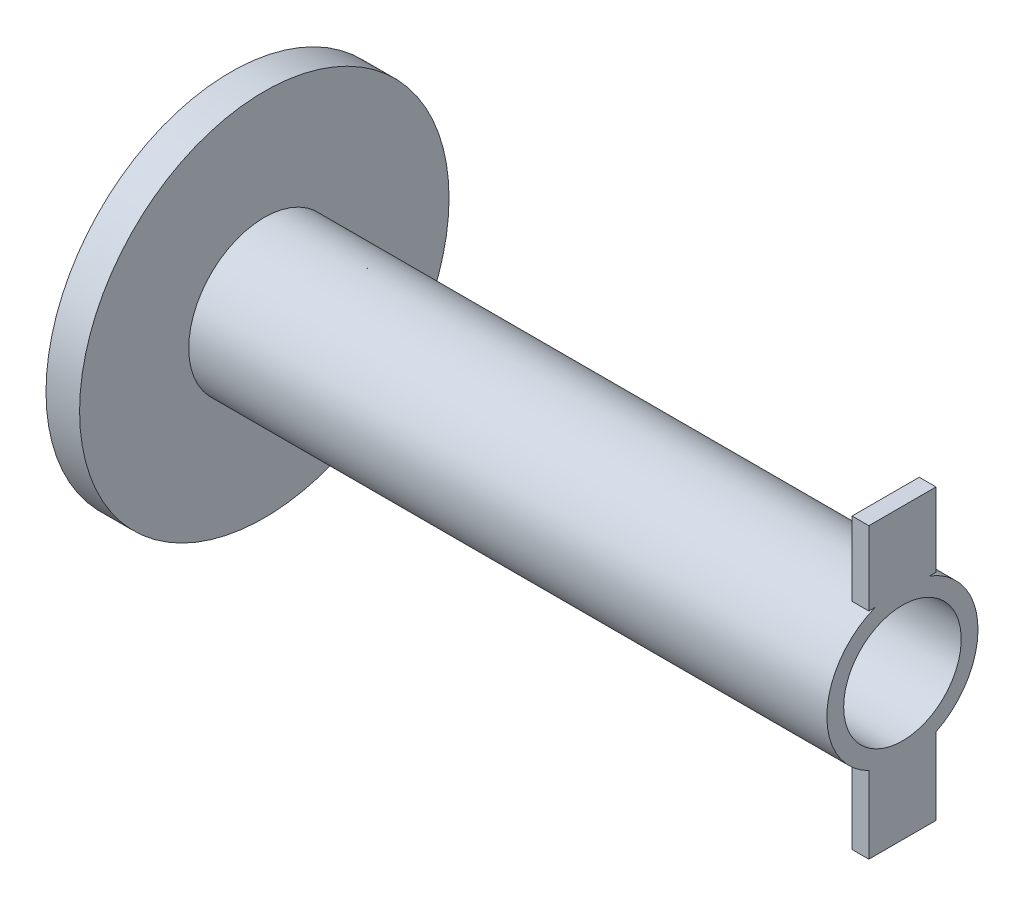
ISO-10303-21;
HEADER;
FILE_DESCRIPTION(('STEP AP214'),'2;1');
FILE_NAME('part.step','',(''),(''),'','','');
FILE_SCHEMA(('AUTOMOTIVE_DESIGN { 1 0 10303 214 1 1 1 1 }'));
ENDSEC;
DATA;
#1=APPLICATION_CONTEXT('core data for automotive mechanical design processes');
#2=APPLICATION_PROTOCOL_DEFINITION('international standard','automotive_design',2000,#1);
#3=PRODUCT_CONTEXT('',#1,'mechanical');
#4=PRODUCT('Part','Part','',(#3));
#5=PRODUCT_RELATED_PRODUCT_CATEGORY('part','',(#4));
#6=PRODUCT_DEFINITION_FORMATION('','',#4);
#7=PRODUCT_DEFINITION_CONTEXT('part definition',#1,'design');
#8=PRODUCT_DEFINITION('design','',#6,#7);
#9=PRODUCT_DEFINITION_SHAPE('','',#8);
#10=(LENGTH_UNIT() NAMED_UNIT(*) SI_UNIT(.MILLI.,.METRE.));
#11=(NAMED_UNIT(*) PLANE_ANGLE_UNIT() SI_UNIT($,.RADIAN.));
#12=(NAMED_UNIT(*) SI_UNIT($,.STERADIAN.) SOLID_ANGLE_UNIT());
#13=UNCERTAINTY_MEASURE_WITH_UNIT(LENGTH_MEASURE(1.E-05),#10,'distance_accuracy_value','');
#14=(GEOMETRIC_REPRESENTATION_CONTEXT(3) GLOBAL_UNCERTAINTY_ASSIGNED_CONTEXT((#13)) GLOBAL_UNIT_ASSIGNED_CONTEXT((#10,
#11,#12)) REPRESENTATION_CONTEXT('',''));
#15=CARTESIAN_POINT('',(0.,0.,0.));
#16=DIRECTION('',(0.,0.,1.));
#17=DIRECTION('',(1.,0.,0.));
#18=AXIS2_PLACEMENT_3D('',#15,#16,#17);
#19=CARTESIAN_POINT('',(10.,0.,0.));
#20=DIRECTION('',(-1.,0.,0.));
#21=DIRECTION('',(0.,0.,1.));
#22=AXIS2_PLACEMENT_3D('',#19,#20,#21);
#23=CYLINDRICAL_SURFACE('',#22,55.);
#24=CARTESIAN_POINT('',(10.,0.,0.));
#25=DIRECTION('',(1.,0.,0.));
#26=DIRECTION('',(0.,0.,-1.));
#27=AXIS2_PLACEMENT_3D('',#24,#25,#26);
#28=CIRCLE('',#27,55.);
#29=CARTESIAN_POINT('',(10.,0.,-55.));
#30=VERTEX_POINT('',#29);
#31=EDGE_CURVE('E198',#30,#30,#28,.T.);
#32=ORIENTED_EDGE('',*,*,#31,.F.);
#33=EDGE_LOOP('',(#32));
#34=FACE_BOUND('',#33,.T.);
#35=CARTESIAN_POINT('',(0.,0.,0.));
#36=DIRECTION('',(1.,0.,0.));
#37=DIRECTION('',(0.,0.,-1.));
#38=AXIS2_PLACEMENT_3D('',#35,#36,#37);
#39=CIRCLE('',#38,55.);
#40=CARTESIAN_POINT('',(0.,0.,-55.));
#41=VERTEX_POINT('',#40);
#42=EDGE_CURVE('E194',#41,#41,#39,.T.);
#43=ORIENTED_EDGE('',*,*,#42,.T.);
#44=EDGE_LOOP('',(#43));
#45=FACE_BOUND('',#44,.T.);
#46=ADVANCED_FACE('F36',(#34,#45),#23,.T.);
#47=CARTESIAN_POINT('',(10.,0.,0.));
#48=DIRECTION('',(1.,0.,0.));
#49=DIRECTION('',(0.,0.,-1.));
#50=AXIS2_PLACEMENT_3D('',#47,#48,#49);
#51=PLANE('',#50);
#52=CARTESIAN_POINT('',(10.,0.,0.));
#53=DIRECTION('',(1.,0.,0.));
#54=DIRECTION('',(0.,0.,-1.));
#55=AXIS2_PLACEMENT_3D('',#52,#53,#54);
#56=CIRCLE('',#55,22.5);
#57=CARTESIAN_POINT('',(10.,0.,-22.5));
#58=VERTEX_POINT('',#57);
#59=EDGE_CURVE('E195',#58,#58,#56,.T.);
#60=ORIENTED_EDGE('',*,*,#59,.F.);
#61=EDGE_LOOP('',(#60));
#62=FACE_BOUND('',#61,.T.);
#63=ORIENTED_EDGE('',*,*,#31,.T.);
#64=EDGE_LOOP('',(#63));
#65=FACE_BOUND('',#64,.T.);
#66=ADVANCED_FACE('F231',(#62,#65),#51,.T.);
#67=CARTESIAN_POINT('',(0.,0.,0.));
#68=DIRECTION('',(1.,0.,0.));
#69=DIRECTION('',(0.,0.,-1.));
#70=AXIS2_PLACEMENT_3D('',#67,#68,#69);
#71=PLANE('',#70);
#72=CARTESIAN_POINT('',(0.,0.,0.));
#73=DIRECTION('',(1.,0.,0.));
#74=DIRECTION('',(0.,0.,-1.));
#75=AXIS2_PLACEMENT_3D('',#72,#73,#74);
#76=CIRCLE('',#75,17.5);
#77=CARTESIAN_POINT('',(0.,0.,-17.5));
#78=VERTEX_POINT('',#77);
#79=EDGE_CURVE('E188',#78,#78,#76,.T.);
#80=ORIENTED_EDGE('',*,*,#79,.T.);
#81=EDGE_LOOP('',(#80));
#82=FACE_BOUND('',#81,.T.);
#83=ORIENTED_EDGE('',*,*,#42,.F.);
#84=EDGE_LOOP('',(#83));
#85=FACE_BOUND('',#84,.T.);
#86=ADVANCED_FACE('F228',(#82,#85),#71,.F.);
#87=CARTESIAN_POINT('',(200.,0.,0.));
#88=DIRECTION('',(-1.,0.,0.));
#89=DIRECTION('',(0.,0.,1.));
#90=AXIS2_PLACEMENT_3D('',#87,#88,#89);
#91=CYLINDRICAL_SURFACE('',#90,22.5);
#92=CARTESIAN_POINT('',(200.,0.,0.));
#93=DIRECTION('',(1.,0.,0.));
#94=DIRECTION('',(0.,0.,-1.));
#95=AXIS2_PLACEMENT_3D('',#92,#93,#94);
#96=CIRCLE('',#95,22.5);
#97=CARTESIAN_POINT('',(200.,-20.1556443707464,-10.));
#98=VERTEX_POINT('',#97);
#99=CARTESIAN_POINT('',(200.,21.,-8.07774721070176));
#100=VERTEX_POINT('',#99);
#101=EDGE_CURVE('E191',#98,#100,#96,.T.);
#102=ORIENTED_EDGE('',*,*,#101,.F.);
#103=DIRECTION('',(-1.,0.,0.));
#104=VECTOR('',#103,1.);
#105=CARTESIAN_POINT('',(200.,-20.1556443707464,-10.));
#106=LINE('',#105,#104);
#107=CARTESIAN_POINT('',(195.,-20.1556443707464,-10.));
#108=VERTEX_POINT('',#107);
#109=EDGE_CURVE('E144',#98,#108,#106,.T.);
#110=ORIENTED_EDGE('',*,*,#109,.T.);
#111=CARTESIAN_POINT('',(195.,0.,0.));
#112=DIRECTION('',(1.,0.,0.));
#113=DIRECTION('',(0.,0.,-1.));
#114=AXIS2_PLACEMENT_3D('',#111,#112,#113);
#115=CIRCLE('',#114,22.5);
#116=CARTESIAN_POINT('',(195.,-20.1556443707464,10.));
#117=VERTEX_POINT('',#116);
#118=EDGE_CURVE('E11',#117,#108,#115,.T.);
#119=ORIENTED_EDGE('',*,*,#118,.F.);
#120=DIRECTION('',(-1.,0.,0.));
#121=VECTOR('',#120,1.);
#122=CARTESIAN_POINT('',(200.,-20.1556443707464,10.));
#123=LINE('',#122,#121);
#124=CARTESIAN_POINT('',(200.,-20.1556443707464,10.));
#125=VERTEX_POINT('',#124);
#126=EDGE_CURVE('E119',#117,#125,#123,.F.);
#127=ORIENTED_EDGE('',*,*,#126,.T.);
#128=CARTESIAN_POINT('',(200.,21.,8.07774721070176));
#129=VERTEX_POINT('',#128);
#130=EDGE_CURVE('E192',#129,#125,#96,.T.);
#131=ORIENTED_EDGE('',*,*,#130,.F.);
#132=DIRECTION('',(-1.,0.,0.));
#133=VECTOR('',#132,1.);
#134=CARTESIAN_POINT('',(200.,21.,8.07774721070176));
#135=LINE('',#134,#133);
#136=CARTESIAN_POINT('',(195.,21.,8.07774721070176));
#137=VERTEX_POINT('',#136);
#138=EDGE_CURVE('E182',#129,#137,#135,.T.);
#139=ORIENTED_EDGE('',*,*,#138,.T.);
#140=CARTESIAN_POINT('',(195.,0.,0.));
#141=DIRECTION('',(1.,0.,0.));
#142=DIRECTION('',(0.,0.,-1.));
#143=AXIS2_PLACEMENT_3D('',#140,#141,#142);
#144=CIRCLE('',#143,22.5);
#145=CARTESIAN_POINT('',(195.,21.,-8.07774721070176));
#146=VERTEX_POINT('',#145);
#147=EDGE_CURVE('E43',#146,#137,#144,.T.);
#148=ORIENTED_EDGE('',*,*,#147,.F.);
#149=DIRECTION('',(-1.,0.,0.));
#150=VECTOR('',#149,1.);
#151=CARTESIAN_POINT('',(200.,21.,-8.07774721070176));
#152=LINE('',#151,#150);
#153=EDGE_CURVE('E174',#146,#100,#152,.F.);
#154=ORIENTED_EDGE('',*,*,#153,.T.);
#155=EDGE_LOOP('',(#102,#110,#119,#127,#131,#139,#148,#154));
#156=FACE_BOUND('',#155,.T.);
#157=ORIENTED_EDGE('',*,*,#59,.T.);
#158=EDGE_LOOP('',(#157));
#159=FACE_BOUND('',#158,.T.);
#160=ADVANCED_FACE('F214',(#156,#159),#91,.T.);
#161=CARTESIAN_POINT('',(200.,0.,0.));
#162=DIRECTION('',(1.,0.,0.));
#163=DIRECTION('',(0.,0.,-1.));
#164=AXIS2_PLACEMENT_3D('',#161,#162,#163);
#165=PLANE('',#164);
#166=ORIENTED_EDGE('',*,*,#130,.T.);
#167=DIRECTION('',(0.,-1.,0.));
#168=VECTOR('',#167,1.);
#169=CARTESIAN_POINT('',(200.,-20.,10.));
#170=LINE('',#169,#168);
#171=CARTESIAN_POINT('',(200.,-43.,9.99999999999999));
#172=VERTEX_POINT('',#171);
#173=EDGE_CURVE('E139',#125,#172,#170,.T.);
#174=ORIENTED_EDGE('',*,*,#173,.T.);
#175=DIRECTION('',(0.,0.,-1.));
#176=VECTOR('',#175,1.);
#177=CARTESIAN_POINT('',(200.,-43.,9.99999999999999));
#178=LINE('',#177,#176);
#179=CARTESIAN_POINT('',(200.,-43.,-10.));
#180=VERTEX_POINT('',#179);
#181=EDGE_CURVE('E129',#172,#180,#178,.T.);
#182=ORIENTED_EDGE('',*,*,#181,.T.);
#183=DIRECTION('',(0.,1.,0.));
#184=VECTOR('',#183,1.);
#185=CARTESIAN_POINT('',(200.,-20.,-10.));
#186=LINE('',#185,#184);
#187=EDGE_CURVE('E50',#180,#98,#186,.T.);
#188=ORIENTED_EDGE('',*,*,#187,.T.);
#189=ORIENTED_EDGE('',*,*,#101,.T.);
#190=DIRECTION('',(0.,0.,-1.));
#191=VECTOR('',#190,1.);
#192=CARTESIAN_POINT('',(200.,21.,10.));
#193=LINE('',#192,#191);
#194=CARTESIAN_POINT('',(200.,21.,-10.));
#195=VERTEX_POINT('',#194);
#196=EDGE_CURVE('E169',#100,#195,#193,.T.);
#197=ORIENTED_EDGE('',*,*,#196,.T.);
#198=DIRECTION('',(0.,1.,0.));
#199=VECTOR('',#198,1.);
#200=CARTESIAN_POINT('',(200.,43.,-10.));
#201=LINE('',#200,#199);
#202=CARTESIAN_POINT('',(200.,43.,-10.));
#203=VERTEX_POINT('',#202);
#204=EDGE_CURVE('E147',#195,#203,#201,.T.);
#205=ORIENTED_EDGE('',*,*,#204,.T.);
#206=DIRECTION('',(0.,0.,1.));
#207=VECTOR('',#206,1.);
#208=CARTESIAN_POINT('',(200.,43.,10.));
#209=LINE('',#208,#207);
#210=CARTESIAN_POINT('',(200.,43.,10.));
#211=VERTEX_POINT('',#210);
#212=EDGE_CURVE('E164',#203,#211,#209,.T.);
#213=ORIENTED_EDGE('',*,*,#212,.T.);
#214=DIRECTION('',(0.,-1.,0.));
#215=VECTOR('',#214,1.);
#216=CARTESIAN_POINT('',(200.,43.,10.));
#217=LINE('',#216,#215);
#218=CARTESIAN_POINT('',(200.,21.,10.));
#219=VERTEX_POINT('',#218);
#220=EDGE_CURVE('E167',#211,#219,#217,.T.);
#221=ORIENTED_EDGE('',*,*,#220,.T.);
#222=EDGE_CURVE('E57',#219,#129,#193,.T.);
#223=ORIENTED_EDGE('',*,*,#222,.T.);
#224=EDGE_LOOP('',(#166,#174,#182,#188,#189,#197,#205,#213,#221,#223));
#225=FACE_BOUND('',#224,.T.);
#226=CARTESIAN_POINT('',(200.,0.,0.));
#227=DIRECTION('',(-1.,0.,0.));
#228=DIRECTION('',(0.,0.,1.));
#229=AXIS2_PLACEMENT_3D('',#226,#227,#228);
#230=CIRCLE('',#229,17.5);
#231=CARTESIAN_POINT('',(200.,0.,17.5));
#232=VERTEX_POINT('',#231);
#233=EDGE_CURVE('E185',#232,#232,#230,.T.);
#234=ORIENTED_EDGE('',*,*,#233,.T.);
#235=EDGE_LOOP('',(#234));
#236=FACE_BOUND('',#235,.T.);
#237=ADVANCED_FACE('F216',(#225,#236),#165,.T.);
#238=CARTESIAN_POINT('',(200.,0.,0.));
#239=DIRECTION('',(-1.,0.,0.));
#240=DIRECTION('',(0.,0.,1.));
#241=AXIS2_PLACEMENT_3D('',#238,#239,#240);
#242=CYLINDRICAL_SURFACE('',#241,17.5);
#243=ORIENTED_EDGE('',*,*,#233,.F.);
#244=EDGE_LOOP('',(#243));
#245=FACE_BOUND('',#244,.T.);
#246=ORIENTED_EDGE('',*,*,#79,.F.);
#247=EDGE_LOOP('',(#246));
#248=FACE_BOUND('',#247,.T.);
#249=ADVANCED_FACE('F219',(#245,#248),#242,.F.);
#250=CARTESIAN_POINT('',(195.,21.,10.));
#251=DIRECTION('',(0.,-1.,0.));
#252=DIRECTION('',(0.,0.,-1.));
#253=AXIS2_PLACEMENT_3D('',#250,#251,#252);
#254=PLANE('',#253);
#255=ORIENTED_EDGE('',*,*,#138,.F.);
#256=ORIENTED_EDGE('',*,*,#222,.F.);
#257=DIRECTION('',(1.,0.,0.));
#258=VECTOR('',#257,1.);
#259=CARTESIAN_POINT('',(195.,21.,10.));
#260=LINE('',#259,#258);
#261=CARTESIAN_POINT('',(195.,21.,10.));
#262=VERTEX_POINT('',#261);
#263=EDGE_CURVE('E175',#262,#219,#260,.T.);
#264=ORIENTED_EDGE('',*,*,#263,.F.);
#265=DIRECTION('',(0.,0.,-1.));
#266=VECTOR('',#265,1.);
#267=CARTESIAN_POINT('',(195.,21.,10.));
#268=LINE('',#267,#266);
#269=EDGE_CURVE('E158',#262,#137,#268,.T.);
#270=ORIENTED_EDGE('',*,*,#269,.T.);
#271=EDGE_LOOP('',(#255,#256,#264,#270));
#272=FACE_BOUND('',#271,.T.);
#273=ADVANCED_FACE('F211',(#272),#254,.T.);
#274=ORIENTED_EDGE('',*,*,#153,.F.);
#275=CARTESIAN_POINT('',(195.,21.,-10.));
#276=VERTEX_POINT('',#275);
#277=EDGE_CURVE('E157',#146,#276,#268,.T.);
#278=ORIENTED_EDGE('',*,*,#277,.T.);
#279=DIRECTION('',(1.,0.,0.));
#280=VECTOR('',#279,1.);
#281=CARTESIAN_POINT('',(195.,21.,-10.));
#282=LINE('',#281,#280);
#283=EDGE_CURVE('E171',#276,#195,#282,.T.);
#284=ORIENTED_EDGE('',*,*,#283,.T.);
#285=ORIENTED_EDGE('',*,*,#196,.F.);
#286=EDGE_LOOP('',(#274,#278,#284,#285));
#287=FACE_BOUND('',#286,.T.);
#288=ADVANCED_FACE('F253',(#287),#254,.T.);
#289=CARTESIAN_POINT('',(195.,43.,-10.));
#290=DIRECTION('',(0.,0.,-1.));
#291=DIRECTION('',(0.,1.,0.));
#292=AXIS2_PLACEMENT_3D('',#289,#290,#291);
#293=PLANE('',#292);
#294=ORIENTED_EDGE('',*,*,#204,.F.);
#295=ORIENTED_EDGE('',*,*,#283,.F.);
#296=DIRECTION('',(0.,1.,0.));
#297=VECTOR('',#296,1.);
#298=CARTESIAN_POINT('',(195.,43.,-10.));
#299=LINE('',#298,#297);
#300=CARTESIAN_POINT('',(195.,43.,-10.));
#301=VERTEX_POINT('',#300);
#302=EDGE_CURVE('E148',#276,#301,#299,.T.);
#303=ORIENTED_EDGE('',*,*,#302,.T.);
#304=DIRECTION('',(1.,0.,0.));
#305=VECTOR('',#304,1.);
#306=CARTESIAN_POINT('',(195.,43.,-10.));
#307=LINE('',#306,#305);
#308=EDGE_CURVE('E161',#301,#203,#307,.T.);
#309=ORIENTED_EDGE('',*,*,#308,.T.);
#310=EDGE_LOOP('',(#294,#295,#303,#309));
#311=FACE_BOUND('',#310,.T.);
#312=ADVANCED_FACE('F249',(#311),#293,.T.);
#313=CARTESIAN_POINT('',(195.,43.,10.));
#314=DIRECTION('',(0.,0.,1.));
#315=DIRECTION('',(0.,-1.,0.));
#316=AXIS2_PLACEMENT_3D('',#313,#314,#315);
#317=PLANE('',#316);
#318=ORIENTED_EDGE('',*,*,#220,.F.);
#319=DIRECTION('',(1.,0.,0.));
#320=VECTOR('',#319,1.);
#321=CARTESIAN_POINT('',(195.,43.,10.));
#322=LINE('',#321,#320);
#323=CARTESIAN_POINT('',(195.,43.,10.));
#324=VERTEX_POINT('',#323);
#325=EDGE_CURVE('E177',#324,#211,#322,.T.);
#326=ORIENTED_EDGE('',*,*,#325,.F.);
#327=DIRECTION('',(0.,-1.,0.));
#328=VECTOR('',#327,1.);
#329=CARTESIAN_POINT('',(195.,43.,10.));
#330=LINE('',#329,#328);
#331=EDGE_CURVE('E154',#324,#262,#330,.T.);
#332=ORIENTED_EDGE('',*,*,#331,.T.);
#333=ORIENTED_EDGE('',*,*,#263,.T.);
#334=EDGE_LOOP('',(#318,#326,#332,#333));
#335=FACE_BOUND('',#334,.T.);
#336=ADVANCED_FACE('F252',(#335),#317,.T.);
#337=CARTESIAN_POINT('',(195.,43.,10.));
#338=DIRECTION('',(0.,1.,0.));
#339=DIRECTION('',(0.,0.,1.));
#340=AXIS2_PLACEMENT_3D('',#337,#338,#339);
#341=PLANE('',#340);
#342=ORIENTED_EDGE('',*,*,#212,.F.);
#343=ORIENTED_EDGE('',*,*,#308,.F.);
#344=DIRECTION('',(0.,0.,1.));
#345=VECTOR('',#344,1.);
#346=CARTESIAN_POINT('',(195.,43.,10.));
#347=LINE('',#346,#345);
#348=EDGE_CURVE('E151',#301,#324,#347,.T.);
#349=ORIENTED_EDGE('',*,*,#348,.T.);
#350=ORIENTED_EDGE('',*,*,#325,.T.);
#351=EDGE_LOOP('',(#342,#343,#349,#350));
#352=FACE_BOUND('',#351,.T.);
#353=ADVANCED_FACE('F255',(#352),#341,.T.);
#354=CARTESIAN_POINT('',(195.,0.,0.));
#355=DIRECTION('',(1.,0.,0.));
#356=DIRECTION('',(0.,0.,-1.));
#357=AXIS2_PLACEMENT_3D('',#354,#355,#356);
#358=PLANE('',#357);
#359=ORIENTED_EDGE('',*,*,#277,.F.);
#360=ORIENTED_EDGE('',*,*,#147,.T.);
#361=ORIENTED_EDGE('',*,*,#269,.F.);
#362=ORIENTED_EDGE('',*,*,#331,.F.);
#363=ORIENTED_EDGE('',*,*,#348,.F.);
#364=ORIENTED_EDGE('',*,*,#302,.F.);
#365=EDGE_LOOP('',(#359,#360,#361,#362,#363,#364));
#366=FACE_BOUND('',#365,.T.);
#367=ADVANCED_FACE('F206',(#366),#358,.F.);
#368=CARTESIAN_POINT('',(195.,-20.,-10.));
#369=DIRECTION('',(0.,0.,-1.));
#370=DIRECTION('',(0.,1.,0.));
#371=AXIS2_PLACEMENT_3D('',#368,#369,#370);
#372=PLANE('',#371);
#373=ORIENTED_EDGE('',*,*,#109,.F.);
#374=ORIENTED_EDGE('',*,*,#187,.F.);
#375=DIRECTION('',(1.,0.,0.));
#376=VECTOR('',#375,1.);
#377=CARTESIAN_POINT('',(195.,-43.,-10.));
#378=LINE('',#377,#376);
#379=CARTESIAN_POINT('',(195.,-43.,-10.));
#380=VERTEX_POINT('',#379);
#381=EDGE_CURVE('E130',#380,#180,#378,.T.);
#382=ORIENTED_EDGE('',*,*,#381,.F.);
#383=DIRECTION('',(0.,1.,0.));
#384=VECTOR('',#383,1.);
#385=CARTESIAN_POINT('',(195.,-20.,-10.));
#386=LINE('',#385,#384);
#387=EDGE_CURVE('E124',#380,#108,#386,.T.);
#388=ORIENTED_EDGE('',*,*,#387,.T.);
#389=EDGE_LOOP('',(#373,#374,#382,#388));
#390=FACE_BOUND('',#389,.T.);
#391=ADVANCED_FACE('F266',(#390),#372,.T.);
#392=CARTESIAN_POINT('',(195.,-20.,10.));
#393=DIRECTION('',(0.,0.,1.));
#394=DIRECTION('',(0.,-1.,0.));
#395=AXIS2_PLACEMENT_3D('',#392,#393,#394);
#396=PLANE('',#395);
#397=ORIENTED_EDGE('',*,*,#126,.F.);
#398=DIRECTION('',(0.,-1.,0.));
#399=VECTOR('',#398,1.);
#400=CARTESIAN_POINT('',(195.,-20.,10.));
#401=LINE('',#400,#399);
#402=CARTESIAN_POINT('',(195.,-43.,9.99999999999999));
#403=VERTEX_POINT('',#402);
#404=EDGE_CURVE('E113',#117,#403,#401,.T.);
#405=ORIENTED_EDGE('',*,*,#404,.T.);
#406=DIRECTION('',(1.,0.,0.));
#407=VECTOR('',#406,1.);
#408=CARTESIAN_POINT('',(195.,-43.,9.99999999999999));
#409=LINE('',#408,#407);
#410=EDGE_CURVE('E116',#403,#172,#409,.T.);
#411=ORIENTED_EDGE('',*,*,#410,.T.);
#412=ORIENTED_EDGE('',*,*,#173,.F.);
#413=EDGE_LOOP('',(#397,#405,#411,#412));
#414=FACE_BOUND('',#413,.T.);
#415=ADVANCED_FACE('F115',(#414),#396,.T.);
#416=CARTESIAN_POINT('',(195.,-43.,9.99999999999999));
#417=DIRECTION('',(0.,-1.,0.));
#418=DIRECTION('',(0.,0.,-1.));
#419=AXIS2_PLACEMENT_3D('',#416,#417,#418);
#420=PLANE('',#419);
#421=ORIENTED_EDGE('',*,*,#181,.F.);
#422=ORIENTED_EDGE('',*,*,#410,.F.);
#423=DIRECTION('',(0.,0.,-1.));
#424=VECTOR('',#423,1.);
#425=CARTESIAN_POINT('',(195.,-43.,9.99999999999999));
#426=LINE('',#425,#424);
#427=EDGE_CURVE('E123',#403,#380,#426,.T.);
#428=ORIENTED_EDGE('',*,*,#427,.T.);
#429=ORIENTED_EDGE('',*,*,#381,.T.);
#430=EDGE_LOOP('',(#421,#422,#428,#429));
#431=FACE_BOUND('',#430,.T.);
#432=ADVANCED_FACE('F128',(#431),#420,.T.);
#433=CARTESIAN_POINT('',(195.,0.,0.));
#434=DIRECTION('',(1.,0.,0.));
#435=DIRECTION('',(0.,0.,-1.));
#436=AXIS2_PLACEMENT_3D('',#433,#434,#435);
#437=PLANE('',#436);
#438=ORIENTED_EDGE('',*,*,#404,.F.);
#439=ORIENTED_EDGE('',*,*,#118,.T.);
#440=ORIENTED_EDGE('',*,*,#387,.F.);
#441=ORIENTED_EDGE('',*,*,#427,.F.);
#442=EDGE_LOOP('',(#438,#439,#440,#441));
#443=FACE_BOUND('',#442,.T.);
#444=ADVANCED_FACE('F133',(#443),#437,.F.);
#445=CLOSED_SHELL('',(#46,#66,#86,#160,#237,#249,#273,#288,#312,#336,#353,#367,#391,#415,#432,#444));
#446=MANIFOLD_SOLID_BREP('B2',#445);
#447=ADVANCED_BREP_SHAPE_REPRESENTATION('',(#18,#446),#14);
#448=SHAPE_DEFINITION_REPRESENTATION(#9,#447);
ENDSEC;
END-ISO-10303-21;
